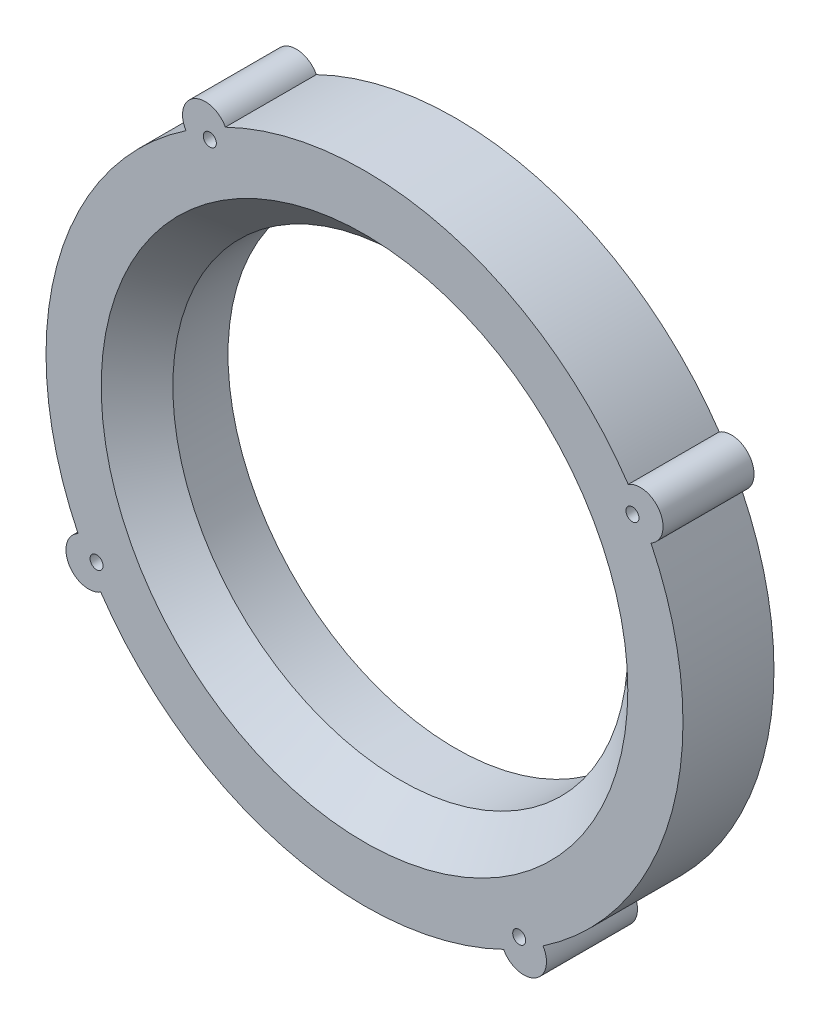
ISO-10303-21;
HEADER;
FILE_DESCRIPTION(('STEP AP214'),'2;1');
FILE_NAME('part.step','',(''),(''),'','','');
FILE_SCHEMA(('AUTOMOTIVE_DESIGN { 1 0 10303 214 1 1 1 1 }'));
ENDSEC;
DATA;
#1=APPLICATION_CONTEXT('core data for automotive mechanical design processes');
#2=APPLICATION_PROTOCOL_DEFINITION('international standard','automotive_design',2000,#1);
#3=PRODUCT_CONTEXT('',#1,'mechanical');
#4=PRODUCT('Part','Part','',(#3));
#5=PRODUCT_RELATED_PRODUCT_CATEGORY('part','',(#4));
#6=PRODUCT_DEFINITION_FORMATION('','',#4);
#7=PRODUCT_DEFINITION_CONTEXT('part definition',#1,'design');
#8=PRODUCT_DEFINITION('design','',#6,#7);
#9=PRODUCT_DEFINITION_SHAPE('','',#8);
#10=(LENGTH_UNIT() NAMED_UNIT(*) SI_UNIT(.MILLI.,.METRE.));
#11=(NAMED_UNIT(*) PLANE_ANGLE_UNIT() SI_UNIT($,.RADIAN.));
#12=(NAMED_UNIT(*) SI_UNIT($,.STERADIAN.) SOLID_ANGLE_UNIT());
#13=UNCERTAINTY_MEASURE_WITH_UNIT(LENGTH_MEASURE(1.E-05),#10,'distance_accuracy_value','');
#14=(GEOMETRIC_REPRESENTATION_CONTEXT(3) GLOBAL_UNCERTAINTY_ASSIGNED_CONTEXT((#13)) GLOBAL_UNIT_ASSIGNED_CONTEXT((#10,
#11,#12)) REPRESENTATION_CONTEXT('',''));
#15=CARTESIAN_POINT('',(0.,0.,0.));
#16=DIRECTION('',(0.,0.,1.));
#17=DIRECTION('',(1.,0.,0.));
#18=AXIS2_PLACEMENT_3D('',#15,#16,#17);
#19=CARTESIAN_POINT('',(-44.4500000000001,76.9896583964365,25.4));
#20=DIRECTION('',(0.,0.,-1.));
#21=DIRECTION('',(-1.,0.,0.));
#22=AXIS2_PLACEMENT_3D('',#19,#20,#21);
#23=CYLINDRICAL_SURFACE('',#22,6.35000000000021);
#24=CARTESIAN_POINT('',(-44.4500000000001,76.9896583964365,0.));
#25=DIRECTION('',(0.,0.,1.));
#26=DIRECTION('',(1.,0.,0.));
#27=AXIS2_PLACEMENT_3D('',#24,#25,#26);
#28=CIRCLE('',#27,6.35000000000021);
#29=CARTESIAN_POINT('',(-38.8408541298616,79.9662306881024,0.));
#30=VERTEX_POINT('',#29);
#31=CARTESIAN_POINT('',(-49.8323601558529,73.6202817251969,0.));
#32=VERTEX_POINT('',#31);
#33=EDGE_CURVE('E142',#30,#32,#28,.T.);
#34=ORIENTED_EDGE('',*,*,#33,.T.);
#35=DIRECTION('',(0.,0.,-1.));
#36=VECTOR('',#35,1.);
#37=CARTESIAN_POINT('',(-49.8323601558529,73.6202817251969,25.4));
#38=LINE('',#37,#36);
#39=CARTESIAN_POINT('',(-49.8323601558529,73.6202817251969,25.4));
#40=VERTEX_POINT('',#39);
#41=EDGE_CURVE('E170',#40,#32,#38,.T.);
#42=ORIENTED_EDGE('',*,*,#41,.F.);
#43=CARTESIAN_POINT('',(-44.4500000000001,76.9896583964365,25.4));
#44=DIRECTION('',(0.,0.,1.));
#45=DIRECTION('',(1.,0.,0.));
#46=AXIS2_PLACEMENT_3D('',#43,#44,#45);
#47=CIRCLE('',#46,6.35000000000021);
#48=CARTESIAN_POINT('',(-38.8408541298616,79.9662306881024,25.4));
#49=VERTEX_POINT('',#48);
#50=EDGE_CURVE('E157',#49,#40,#47,.T.);
#51=ORIENTED_EDGE('',*,*,#50,.F.);
#52=DIRECTION('',(0.,0.,-1.));
#53=VECTOR('',#52,1.);
#54=CARTESIAN_POINT('',(-38.8408541298616,79.9662306881024,25.4));
#55=LINE('',#54,#53);
#56=EDGE_CURVE('E138',#49,#30,#55,.T.);
#57=ORIENTED_EDGE('',*,*,#56,.T.);
#58=EDGE_LOOP('',(#34,#42,#51,#57));
#59=FACE_BOUND('',#58,.T.);
#60=ADVANCED_FACE('F43',(#59),#23,.T.);
#61=CARTESIAN_POINT('',(0.,0.,25.4));
#62=DIRECTION('',(0.,0.,-1.));
#63=DIRECTION('',(-1.,0.,0.));
#64=AXIS2_PLACEMENT_3D('',#61,#62,#63);
#65=CYLINDRICAL_SURFACE('',#64,88.9);
#66=CARTESIAN_POINT('',(0.,0.,0.));
#67=DIRECTION('',(0.,0.,1.));
#68=DIRECTION('',(1.,0.,0.));
#69=AXIS2_PLACEMENT_3D('',#66,#67,#68);
#70=CIRCLE('',#69,88.9);
#71=CARTESIAN_POINT('',(-79.9662306881025,-38.8408541298614,0.));
#72=VERTEX_POINT('',#71);
#73=EDGE_CURVE('E145',#32,#72,#70,.T.);
#74=ORIENTED_EDGE('',*,*,#73,.T.);
#75=DIRECTION('',(0.,0.,-1.));
#76=VECTOR('',#75,1.);
#77=CARTESIAN_POINT('',(-79.9662306881025,-38.8408541298614,25.4));
#78=LINE('',#77,#76);
#79=CARTESIAN_POINT('',(-79.9662306881025,-38.8408541298614,25.4));
#80=VERTEX_POINT('',#79);
#81=EDGE_CURVE('E167',#80,#72,#78,.T.);
#82=ORIENTED_EDGE('',*,*,#81,.F.);
#83=CARTESIAN_POINT('',(0.,0.,25.4));
#84=DIRECTION('',(0.,0.,1.));
#85=DIRECTION('',(1.,0.,0.));
#86=AXIS2_PLACEMENT_3D('',#83,#84,#85);
#87=CIRCLE('',#86,88.9);
#88=EDGE_CURVE('E104',#40,#80,#87,.T.);
#89=ORIENTED_EDGE('',*,*,#88,.F.);
#90=ORIENTED_EDGE('',*,*,#41,.T.);
#91=EDGE_LOOP('',(#74,#82,#89,#90));
#92=FACE_BOUND('',#91,.T.);
#93=ADVANCED_FACE('F192',(#92),#65,.T.);
#94=CARTESIAN_POINT('',(-76.9896583964368,-44.4499999999996,25.4));
#95=DIRECTION('',(0.,0.,-1.));
#96=DIRECTION('',(-1.,0.,0.));
#97=AXIS2_PLACEMENT_3D('',#94,#95,#96);
#98=CYLINDRICAL_SURFACE('',#97,6.35);
#99=CARTESIAN_POINT('',(-76.9896583964368,-44.4499999999996,0.));
#100=DIRECTION('',(0.,0.,1.));
#101=DIRECTION('',(1.,0.,0.));
#102=AXIS2_PLACEMENT_3D('',#99,#100,#101);
#103=CIRCLE('',#102,6.35);
#104=CARTESIAN_POINT('',(-73.6202817251975,-49.832360155852,0.));
#105=VERTEX_POINT('',#104);
#106=EDGE_CURVE('E148',#72,#105,#103,.T.);
#107=ORIENTED_EDGE('',*,*,#106,.T.);
#108=DIRECTION('',(0.,0.,-1.));
#109=VECTOR('',#108,1.);
#110=CARTESIAN_POINT('',(-73.6202817251975,-49.832360155852,25.4));
#111=LINE('',#110,#109);
#112=CARTESIAN_POINT('',(-73.6202817251975,-49.832360155852,25.4));
#113=VERTEX_POINT('',#112);
#114=EDGE_CURVE('E164',#113,#105,#111,.T.);
#115=ORIENTED_EDGE('',*,*,#114,.F.);
#116=CARTESIAN_POINT('',(-76.9896583964368,-44.4499999999996,25.4));
#117=DIRECTION('',(0.,0.,1.));
#118=DIRECTION('',(1.,0.,0.));
#119=AXIS2_PLACEMENT_3D('',#116,#117,#118);
#120=CIRCLE('',#119,6.35);
#121=EDGE_CURVE('E256',#80,#113,#120,.T.);
#122=ORIENTED_EDGE('',*,*,#121,.F.);
#123=ORIENTED_EDGE('',*,*,#81,.T.);
#124=EDGE_LOOP('',(#107,#115,#122,#123));
#125=FACE_BOUND('',#124,.T.);
#126=ADVANCED_FACE('F197',(#125),#98,.T.);
#127=CARTESIAN_POINT('',(38.840854129862,-79.9662306881022,0.));
#128=VERTEX_POINT('',#127);
#129=EDGE_CURVE('E149',#105,#128,#70,.T.);
#130=ORIENTED_EDGE('',*,*,#129,.T.);
#131=DIRECTION('',(0.,0.,-1.));
#132=VECTOR('',#131,1.);
#133=CARTESIAN_POINT('',(38.840854129862,-79.9662306881022,25.4));
#134=LINE('',#133,#132);
#135=CARTESIAN_POINT('',(38.840854129862,-79.9662306881022,25.4));
#136=VERTEX_POINT('',#135);
#137=EDGE_CURVE('E161',#136,#128,#134,.T.);
#138=ORIENTED_EDGE('',*,*,#137,.F.);
#139=EDGE_CURVE('E128',#113,#136,#87,.T.);
#140=ORIENTED_EDGE('',*,*,#139,.F.);
#141=ORIENTED_EDGE('',*,*,#114,.T.);
#142=EDGE_LOOP('',(#130,#138,#140,#141));
#143=FACE_BOUND('',#142,.T.);
#144=ADVANCED_FACE('F199',(#143),#65,.T.);
#145=CARTESIAN_POINT('',(44.4500000000001,-76.9896583964365,25.4));
#146=DIRECTION('',(0.,0.,-1.));
#147=DIRECTION('',(-1.,0.,0.));
#148=AXIS2_PLACEMENT_3D('',#145,#146,#147);
#149=CYLINDRICAL_SURFACE('',#148,6.35000000000006);
#150=CARTESIAN_POINT('',(44.4500000000001,-76.9896583964365,0.));
#151=DIRECTION('',(0.,0.,1.));
#152=DIRECTION('',(1.,0.,0.));
#153=AXIS2_PLACEMENT_3D('',#150,#151,#152);
#154=CIRCLE('',#153,6.35000000000006);
#155=CARTESIAN_POINT('',(49.8323601558525,-73.6202817251972,0.));
#156=VERTEX_POINT('',#155);
#157=EDGE_CURVE('E151',#128,#156,#154,.T.);
#158=ORIENTED_EDGE('',*,*,#157,.T.);
#159=DIRECTION('',(0.,0.,-1.));
#160=VECTOR('',#159,1.);
#161=CARTESIAN_POINT('',(49.8323601558525,-73.6202817251972,25.4));
#162=LINE('',#161,#160);
#163=CARTESIAN_POINT('',(49.8323601558525,-73.6202817251972,25.4));
#164=VERTEX_POINT('',#163);
#165=EDGE_CURVE('E133',#164,#156,#162,.T.);
#166=ORIENTED_EDGE('',*,*,#165,.F.);
#167=CARTESIAN_POINT('',(44.4500000000001,-76.9896583964365,25.4));
#168=DIRECTION('',(0.,0.,1.));
#169=DIRECTION('',(1.,0.,0.));
#170=AXIS2_PLACEMENT_3D('',#167,#168,#169);
#171=CIRCLE('',#170,6.35000000000006);
#172=EDGE_CURVE('E123',#136,#164,#171,.T.);
#173=ORIENTED_EDGE('',*,*,#172,.F.);
#174=ORIENTED_EDGE('',*,*,#137,.T.);
#175=EDGE_LOOP('',(#158,#166,#173,#174));
#176=FACE_BOUND('',#175,.T.);
#177=ADVANCED_FACE('F205',(#176),#149,.T.);
#178=CARTESIAN_POINT('',(79.9662306881022,38.840854129862,0.));
#179=VERTEX_POINT('',#178);
#180=EDGE_CURVE('E132',#156,#179,#70,.T.);
#181=ORIENTED_EDGE('',*,*,#180,.T.);
#182=DIRECTION('',(0.,0.,-1.));
#183=VECTOR('',#182,1.);
#184=CARTESIAN_POINT('',(79.9662306881022,38.840854129862,25.4));
#185=LINE('',#184,#183);
#186=CARTESIAN_POINT('',(79.9662306881022,38.840854129862,25.4));
#187=VERTEX_POINT('',#186);
#188=EDGE_CURVE('E129',#187,#179,#185,.T.);
#189=ORIENTED_EDGE('',*,*,#188,.F.);
#190=EDGE_CURVE('E117',#164,#187,#87,.T.);
#191=ORIENTED_EDGE('',*,*,#190,.F.);
#192=ORIENTED_EDGE('',*,*,#165,.T.);
#193=EDGE_LOOP('',(#181,#189,#191,#192));
#194=FACE_BOUND('',#193,.T.);
#195=ADVANCED_FACE('F130',(#194),#65,.T.);
#196=CARTESIAN_POINT('',(76.9896583964365,44.4500000000001,25.4));
#197=DIRECTION('',(0.,0.,-1.));
#198=DIRECTION('',(-1.,0.,0.));
#199=AXIS2_PLACEMENT_3D('',#196,#197,#198);
#200=CYLINDRICAL_SURFACE('',#199,6.34999999999998);
#201=CARTESIAN_POINT('',(76.9896583964365,44.4500000000001,0.));
#202=DIRECTION('',(0.,0.,1.));
#203=DIRECTION('',(1.,0.,0.));
#204=AXIS2_PLACEMENT_3D('',#201,#202,#203);
#205=CIRCLE('',#204,6.34999999999998);
#206=CARTESIAN_POINT('',(73.6202817251972,49.8323601558525,0.));
#207=VERTEX_POINT('',#206);
#208=EDGE_CURVE('E89',#179,#207,#205,.T.);
#209=ORIENTED_EDGE('',*,*,#208,.T.);
#210=DIRECTION('',(0.,0.,-1.));
#211=VECTOR('',#210,1.);
#212=CARTESIAN_POINT('',(73.6202817251972,49.8323601558525,25.4));
#213=LINE('',#212,#211);
#214=CARTESIAN_POINT('',(73.6202817251972,49.8323601558525,25.4));
#215=VERTEX_POINT('',#214);
#216=EDGE_CURVE('E134',#215,#207,#213,.T.);
#217=ORIENTED_EDGE('',*,*,#216,.F.);
#218=CARTESIAN_POINT('',(76.9896583964365,44.4500000000001,25.4));
#219=DIRECTION('',(0.,0.,1.));
#220=DIRECTION('',(1.,0.,0.));
#221=AXIS2_PLACEMENT_3D('',#218,#219,#220);
#222=CIRCLE('',#221,6.34999999999998);
#223=EDGE_CURVE('E121',#187,#215,#222,.T.);
#224=ORIENTED_EDGE('',*,*,#223,.F.);
#225=ORIENTED_EDGE('',*,*,#188,.T.);
#226=EDGE_LOOP('',(#209,#217,#224,#225));
#227=FACE_BOUND('',#226,.T.);
#228=ADVANCED_FACE('F136',(#227),#200,.T.);
#229=EDGE_CURVE('E95',#207,#30,#70,.T.);
#230=ORIENTED_EDGE('',*,*,#229,.T.);
#231=ORIENTED_EDGE('',*,*,#56,.F.);
#232=EDGE_CURVE('E60',#215,#49,#87,.T.);
#233=ORIENTED_EDGE('',*,*,#232,.F.);
#234=ORIENTED_EDGE('',*,*,#216,.T.);
#235=EDGE_LOOP('',(#230,#231,#233,#234));
#236=FACE_BOUND('',#235,.T.);
#237=ADVANCED_FACE('F200',(#236),#65,.T.);
#238=CARTESIAN_POINT('',(0.,0.,25.4));
#239=DIRECTION('',(0.,0.,-1.));
#240=DIRECTION('',(-1.,0.,0.));
#241=AXIS2_PLACEMENT_3D('',#238,#239,#240);
#242=CYLINDRICAL_SURFACE('',#241,63.5);
#243=CARTESIAN_POINT('',(0.,0.,15.4));
#244=DIRECTION('',(0.,0.,1.));
#245=DIRECTION('',(1.,0.,0.));
#246=AXIS2_PLACEMENT_3D('',#243,#244,#245);
#247=CIRCLE('',#246,63.5);
#248=CARTESIAN_POINT('',(63.5,0.,15.4));
#249=VERTEX_POINT('',#248);
#250=EDGE_CURVE('E52',#249,#249,#247,.T.);
#251=ORIENTED_EDGE('',*,*,#250,.T.);
#252=EDGE_LOOP('',(#251));
#253=FACE_BOUND('',#252,.T.);
#254=CARTESIAN_POINT('',(0.,0.,0.));
#255=DIRECTION('',(0.,0.,1.));
#256=DIRECTION('',(1.,0.,0.));
#257=AXIS2_PLACEMENT_3D('',#254,#255,#256);
#258=CIRCLE('',#257,63.5);
#259=CARTESIAN_POINT('',(63.5,0.,0.));
#260=VERTEX_POINT('',#259);
#261=EDGE_CURVE('E154',#260,#260,#258,.T.);
#262=ORIENTED_EDGE('',*,*,#261,.F.);
#263=EDGE_LOOP('',(#262));
#264=FACE_BOUND('',#263,.T.);
#265=ADVANCED_FACE('F174',(#253,#264),#242,.F.);
#266=CARTESIAN_POINT('',(0.,0.,25.4));
#267=DIRECTION('',(0.,0.,1.));
#268=DIRECTION('',(1.,0.,0.));
#269=AXIS2_PLACEMENT_3D('',#266,#267,#268);
#270=PLANE('',#269);
#271=CARTESIAN_POINT('',(-43.1800000000001,74.789953870824,25.4));
#272=DIRECTION('',(0.,0.,1.));
#273=DIRECTION('',(1.,0.,0.));
#274=AXIS2_PLACEMENT_3D('',#271,#272,#273);
#275=CIRCLE('',#274,1.8161);
#276=CARTESIAN_POINT('',(-41.3639000000001,74.789953870824,25.4));
#277=VERTEX_POINT('',#276);
#278=EDGE_CURVE('E234',#277,#277,#275,.T.);
#279=ORIENTED_EDGE('',*,*,#278,.F.);
#280=EDGE_LOOP('',(#279));
#281=FACE_BOUND('',#280,.T.);
#282=CARTESIAN_POINT('',(74.789953870824,43.1800000000001,25.4));
#283=DIRECTION('',(0.,0.,1.));
#284=DIRECTION('',(1.,0.,0.));
#285=AXIS2_PLACEMENT_3D('',#282,#283,#284);
#286=CIRCLE('',#285,1.8161);
#287=CARTESIAN_POINT('',(76.606053870824,43.1800000000001,25.4));
#288=VERTEX_POINT('',#287);
#289=EDGE_CURVE('E239',#288,#288,#286,.T.);
#290=ORIENTED_EDGE('',*,*,#289,.F.);
#291=EDGE_LOOP('',(#290));
#292=FACE_BOUND('',#291,.T.);
#293=CARTESIAN_POINT('',(43.1799999999999,-74.7899538708242,25.4));
#294=DIRECTION('',(0.,0.,1.));
#295=DIRECTION('',(1.,0.,0.));
#296=AXIS2_PLACEMENT_3D('',#293,#294,#295);
#297=CIRCLE('',#296,1.8161);
#298=CARTESIAN_POINT('',(44.9960999999998,-74.7899538708242,25.4));
#299=VERTEX_POINT('',#298);
#300=EDGE_CURVE('E247',#299,#299,#297,.T.);
#301=ORIENTED_EDGE('',*,*,#300,.F.);
#302=EDGE_LOOP('',(#301));
#303=FACE_BOUND('',#302,.T.);
#304=CARTESIAN_POINT('',(-74.7899538708244,-43.1799999999996,25.4));
#305=DIRECTION('',(0.,0.,1.));
#306=DIRECTION('',(1.,0.,0.));
#307=AXIS2_PLACEMENT_3D('',#304,#305,#306);
#308=CIRCLE('',#307,1.8161);
#309=CARTESIAN_POINT('',(-72.9738538708244,-43.1799999999996,25.4));
#310=VERTEX_POINT('',#309);
#311=EDGE_CURVE('E253',#310,#310,#308,.T.);
#312=ORIENTED_EDGE('',*,*,#311,.F.);
#313=EDGE_LOOP('',(#312));
#314=FACE_BOUND('',#313,.T.);
#315=CARTESIAN_POINT('',(0.,0.,25.4));
#316=DIRECTION('',(0.,0.,1.));
#317=DIRECTION('',(1.,0.,0.));
#318=AXIS2_PLACEMENT_3D('',#315,#316,#317);
#319=CIRCLE('',#318,73.5);
#320=CARTESIAN_POINT('',(73.5,0.,25.4));
#321=VERTEX_POINT('',#320);
#322=EDGE_CURVE('E11',#321,#321,#319,.F.);
#323=ORIENTED_EDGE('',*,*,#322,.T.);
#324=EDGE_LOOP('',(#323));
#325=FACE_BOUND('',#324,.T.);
#326=ORIENTED_EDGE('',*,*,#50,.T.);
#327=ORIENTED_EDGE('',*,*,#88,.T.);
#328=ORIENTED_EDGE('',*,*,#121,.T.);
#329=ORIENTED_EDGE('',*,*,#139,.T.);
#330=ORIENTED_EDGE('',*,*,#172,.T.);
#331=ORIENTED_EDGE('',*,*,#190,.T.);
#332=ORIENTED_EDGE('',*,*,#223,.T.);
#333=ORIENTED_EDGE('',*,*,#232,.T.);
#334=EDGE_LOOP('',(#326,#327,#328,#329,#330,#331,#332,#333));
#335=FACE_BOUND('',#334,.T.);
#336=ADVANCED_FACE('F119',(#281,#292,#303,#314,#325,#335),#270,.T.);
#337=CARTESIAN_POINT('',(0.,0.,0.));
#338=DIRECTION('',(0.,0.,1.));
#339=DIRECTION('',(1.,0.,0.));
#340=AXIS2_PLACEMENT_3D('',#337,#338,#339);
#341=PLANE('',#340);
#342=CARTESIAN_POINT('',(-43.1800000000001,74.789953870824,0.));
#343=DIRECTION('',(0.,0.,1.));
#344=DIRECTION('',(1.,0.,0.));
#345=AXIS2_PLACEMENT_3D('',#342,#343,#344);
#346=CIRCLE('',#345,1.8161);
#347=CARTESIAN_POINT('',(-41.3639000000001,74.789953870824,0.));
#348=VERTEX_POINT('',#347);
#349=EDGE_CURVE('E146',#348,#348,#346,.T.);
#350=ORIENTED_EDGE('',*,*,#349,.T.);
#351=EDGE_LOOP('',(#350));
#352=FACE_BOUND('',#351,.T.);
#353=CARTESIAN_POINT('',(74.789953870824,43.1800000000001,0.));
#354=DIRECTION('',(0.,0.,1.));
#355=DIRECTION('',(1.,0.,0.));
#356=AXIS2_PLACEMENT_3D('',#353,#354,#355);
#357=CIRCLE('',#356,1.8161);
#358=CARTESIAN_POINT('',(76.606053870824,43.1800000000001,0.));
#359=VERTEX_POINT('',#358);
#360=EDGE_CURVE('E235',#359,#359,#357,.T.);
#361=ORIENTED_EDGE('',*,*,#360,.T.);
#362=EDGE_LOOP('',(#361));
#363=FACE_BOUND('',#362,.T.);
#364=CARTESIAN_POINT('',(43.1799999999999,-74.7899538708242,0.));
#365=DIRECTION('',(0.,0.,1.));
#366=DIRECTION('',(1.,0.,0.));
#367=AXIS2_PLACEMENT_3D('',#364,#365,#366);
#368=CIRCLE('',#367,1.8161);
#369=CARTESIAN_POINT('',(44.9960999999998,-74.7899538708242,0.));
#370=VERTEX_POINT('',#369);
#371=EDGE_CURVE('E244',#370,#370,#368,.T.);
#372=ORIENTED_EDGE('',*,*,#371,.T.);
#373=EDGE_LOOP('',(#372));
#374=FACE_BOUND('',#373,.T.);
#375=CARTESIAN_POINT('',(-74.7899538708244,-43.1799999999996,0.));
#376=DIRECTION('',(0.,0.,1.));
#377=DIRECTION('',(1.,0.,0.));
#378=AXIS2_PLACEMENT_3D('',#375,#376,#377);
#379=CIRCLE('',#378,1.8161);
#380=CARTESIAN_POINT('',(-72.9738538708244,-43.1799999999996,0.));
#381=VERTEX_POINT('',#380);
#382=EDGE_CURVE('E250',#381,#381,#379,.T.);
#383=ORIENTED_EDGE('',*,*,#382,.T.);
#384=EDGE_LOOP('',(#383));
#385=FACE_BOUND('',#384,.T.);
#386=ORIENTED_EDGE('',*,*,#33,.F.);
#387=ORIENTED_EDGE('',*,*,#229,.F.);
#388=ORIENTED_EDGE('',*,*,#208,.F.);
#389=ORIENTED_EDGE('',*,*,#180,.F.);
#390=ORIENTED_EDGE('',*,*,#157,.F.);
#391=ORIENTED_EDGE('',*,*,#129,.F.);
#392=ORIENTED_EDGE('',*,*,#106,.F.);
#393=ORIENTED_EDGE('',*,*,#73,.F.);
#394=EDGE_LOOP('',(#386,#387,#388,#389,#390,#391,#392,#393));
#395=FACE_BOUND('',#394,.T.);
#396=ORIENTED_EDGE('',*,*,#261,.T.);
#397=EDGE_LOOP('',(#396));
#398=FACE_BOUND('',#397,.T.);
#399=ADVANCED_FACE('F179',(#352,#363,#374,#385,#395,#398),#341,.F.);
#400=CARTESIAN_POINT('',(0.,0.,15.4));
#401=DIRECTION('',(0.,0.,1.));
#402=DIRECTION('',(1.,0.,0.));
#403=AXIS2_PLACEMENT_3D('',#400,#401,#402);
#404=CONICAL_SURFACE('',#403,63.5,0.785398163397451);
#405=ORIENTED_EDGE('',*,*,#322,.F.);
#406=EDGE_LOOP('',(#405));
#407=FACE_BOUND('',#406,.T.);
#408=ORIENTED_EDGE('',*,*,#250,.F.);
#409=EDGE_LOOP('',(#408));
#410=FACE_BOUND('',#409,.T.);
#411=ADVANCED_FACE('F45',(#407,#410),#404,.F.);
#412=CARTESIAN_POINT('',(-74.7899538708244,-43.1799999999996,0.));
#413=DIRECTION('',(0.,0.,1.));
#414=DIRECTION('',(1.,0.,0.));
#415=AXIS2_PLACEMENT_3D('',#412,#413,#414);
#416=CYLINDRICAL_SURFACE('',#415,1.8161);
#417=ORIENTED_EDGE('',*,*,#382,.F.);
#418=EDGE_LOOP('',(#417));
#419=FACE_BOUND('',#418,.T.);
#420=ORIENTED_EDGE('',*,*,#311,.T.);
#421=EDGE_LOOP('',(#420));
#422=FACE_BOUND('',#421,.T.);
#423=ADVANCED_FACE('F178',(#419,#422),#416,.F.);
#424=CARTESIAN_POINT('',(43.1799999999999,-74.7899538708242,0.));
#425=DIRECTION('',(0.,0.,1.));
#426=DIRECTION('',(1.,0.,0.));
#427=AXIS2_PLACEMENT_3D('',#424,#425,#426);
#428=CYLINDRICAL_SURFACE('',#427,1.8161);
#429=ORIENTED_EDGE('',*,*,#371,.F.);
#430=EDGE_LOOP('',(#429));
#431=FACE_BOUND('',#430,.T.);
#432=ORIENTED_EDGE('',*,*,#300,.T.);
#433=EDGE_LOOP('',(#432));
#434=FACE_BOUND('',#433,.T.);
#435=ADVANCED_FACE('F185',(#431,#434),#428,.F.);
#436=CARTESIAN_POINT('',(74.789953870824,43.1800000000001,0.));
#437=DIRECTION('',(0.,0.,1.));
#438=DIRECTION('',(1.,0.,0.));
#439=AXIS2_PLACEMENT_3D('',#436,#437,#438);
#440=CYLINDRICAL_SURFACE('',#439,1.8161);
#441=ORIENTED_EDGE('',*,*,#360,.F.);
#442=EDGE_LOOP('',(#441));
#443=FACE_BOUND('',#442,.T.);
#444=ORIENTED_EDGE('',*,*,#289,.T.);
#445=EDGE_LOOP('',(#444));
#446=FACE_BOUND('',#445,.T.);
#447=ADVANCED_FACE('F219',(#443,#446),#440,.F.);
#448=CARTESIAN_POINT('',(-43.1800000000001,74.789953870824,0.));
#449=DIRECTION('',(0.,0.,1.));
#450=DIRECTION('',(1.,0.,0.));
#451=AXIS2_PLACEMENT_3D('',#448,#449,#450);
#452=CYLINDRICAL_SURFACE('',#451,1.8161);
#453=ORIENTED_EDGE('',*,*,#349,.F.);
#454=EDGE_LOOP('',(#453));
#455=FACE_BOUND('',#454,.T.);
#456=ORIENTED_EDGE('',*,*,#278,.T.);
#457=EDGE_LOOP('',(#456));
#458=FACE_BOUND('',#457,.T.);
#459=ADVANCED_FACE('F223',(#455,#458),#452,.F.);
#460=CLOSED_SHELL('',(#60,#93,#126,#144,#177,#195,#228,#237,#265,#336,#399,#411,#423,#435,#447,#459));
#461=MANIFOLD_SOLID_BREP('B2',#460);
#462=ADVANCED_BREP_SHAPE_REPRESENTATION('',(#18,#461),#14);
#463=SHAPE_DEFINITION_REPRESENTATION(#9,#462);
ENDSEC;
END-ISO-10303-21;
